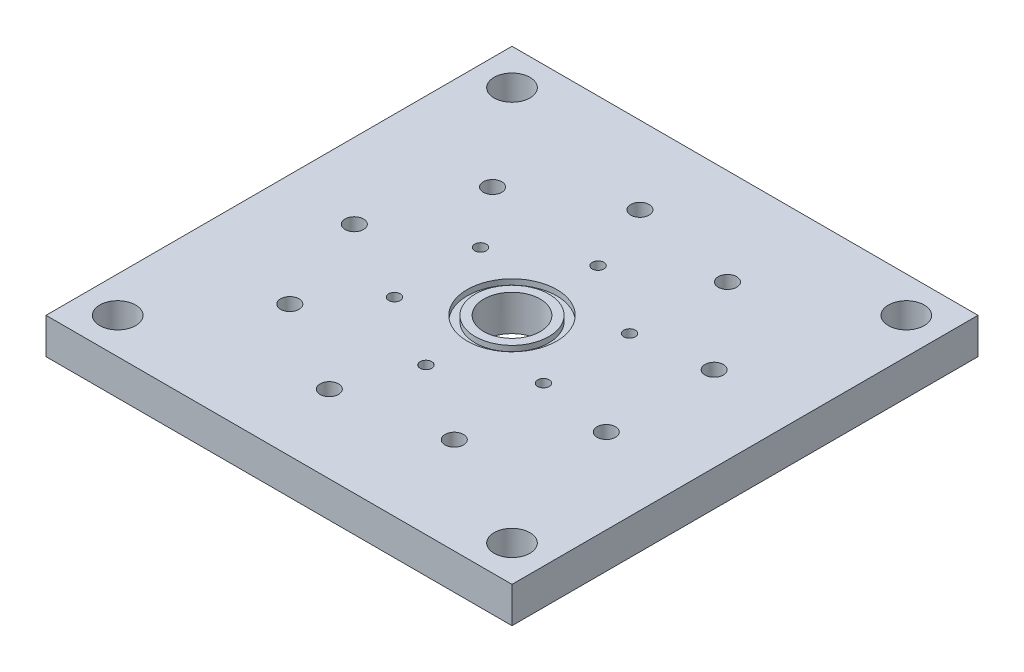
ISO-10303-21;
HEADER;
FILE_DESCRIPTION(('STEP AP214'),'2;1');
FILE_NAME('part.step','',(''),(''),'','','');
FILE_SCHEMA(('AUTOMOTIVE_DESIGN { 1 0 10303 214 1 1 1 1 }'));
ENDSEC;
DATA;
#1=APPLICATION_CONTEXT('core data for automotive mechanical design processes');
#2=APPLICATION_PROTOCOL_DEFINITION('international standard','automotive_design',2000,#1);
#3=PRODUCT_CONTEXT('',#1,'mechanical');
#4=PRODUCT('Part','Part','',(#3));
#5=PRODUCT_RELATED_PRODUCT_CATEGORY('part','',(#4));
#6=PRODUCT_DEFINITION_FORMATION('','',#4);
#7=PRODUCT_DEFINITION_CONTEXT('part definition',#1,'design');
#8=PRODUCT_DEFINITION('design','',#6,#7);
#9=PRODUCT_DEFINITION_SHAPE('','',#8);
#10=(LENGTH_UNIT() NAMED_UNIT(*) SI_UNIT(.MILLI.,.METRE.));
#11=(NAMED_UNIT(*) PLANE_ANGLE_UNIT() SI_UNIT($,.RADIAN.));
#12=(NAMED_UNIT(*) SI_UNIT($,.STERADIAN.) SOLID_ANGLE_UNIT());
#13=UNCERTAINTY_MEASURE_WITH_UNIT(LENGTH_MEASURE(1.E-05),#10,'distance_accuracy_value','');
#14=(GEOMETRIC_REPRESENTATION_CONTEXT(3) GLOBAL_UNCERTAINTY_ASSIGNED_CONTEXT((#13)) GLOBAL_UNIT_ASSIGNED_CONTEXT((#10,
#11,#12)) REPRESENTATION_CONTEXT('',''));
#15=CARTESIAN_POINT('',(0.,0.,0.));
#16=DIRECTION('',(0.,0.,1.));
#17=DIRECTION('',(1.,0.,0.));
#18=AXIS2_PLACEMENT_3D('',#15,#16,#17);
#19=CARTESIAN_POINT('',(0.,6.35,0.));
#20=DIRECTION('',(0.,-1.,0.));
#21=DIRECTION('',(0.,0.,-1.));
#22=AXIS2_PLACEMENT_3D('',#19,#20,#21);
#23=PLANE('',#22);
#24=CARTESIAN_POINT('',(0.,6.35,0.));
#25=DIRECTION('',(0.,1.,0.));
#26=DIRECTION('',(0.,0.,1.));
#27=AXIS2_PLACEMENT_3D('',#24,#25,#26);
#28=CIRCLE('',#27,4.99999);
#29=CARTESIAN_POINT('',(0.,6.35,4.99999));
#30=VERTEX_POINT('',#29);
#31=EDGE_CURVE('E112',#30,#30,#28,.T.);
#32=ORIENTED_EDGE('',*,*,#31,.F.);
#33=EDGE_LOOP('',(#32));
#34=FACE_BOUND('',#33,.T.);
#35=CARTESIAN_POINT('',(0.,6.35,0.));
#36=DIRECTION('',(0.,1.,0.));
#37=DIRECTION('',(0.,0.,1.));
#38=AXIS2_PLACEMENT_3D('',#35,#36,#37);
#39=CIRCLE('',#38,6.5278);
#40=CARTESIAN_POINT('',(0.,6.35,6.5278));
#41=VERTEX_POINT('',#40);
#42=EDGE_CURVE('E135',#41,#41,#39,.T.);
#43=ORIENTED_EDGE('',*,*,#42,.T.);
#44=EDGE_LOOP('',(#43));
#45=FACE_BOUND('',#44,.T.);
#46=ADVANCED_FACE('F45',(#34,#45),#23,.F.);
#47=CARTESIAN_POINT('',(41.275,6.35,41.275));
#48=DIRECTION('',(-1.,0.,0.));
#49=DIRECTION('',(0.,0.,1.));
#50=AXIS2_PLACEMENT_3D('',#47,#48,#49);
#51=PLANE('',#50);
#52=DIRECTION('',(0.,0.,-1.));
#53=VECTOR('',#52,1.);
#54=CARTESIAN_POINT('',(41.275,0.,41.275));
#55=LINE('',#54,#53);
#56=CARTESIAN_POINT('',(41.275,0.,41.275));
#57=VERTEX_POINT('',#56);
#58=CARTESIAN_POINT('',(41.275,0.,-41.275));
#59=VERTEX_POINT('',#58);
#60=EDGE_CURVE('E109',#57,#59,#55,.T.);
#61=ORIENTED_EDGE('',*,*,#60,.T.);
#62=DIRECTION('',(0.,-1.,0.));
#63=VECTOR('',#62,1.);
#64=CARTESIAN_POINT('',(41.275,6.35,-41.275));
#65=LINE('',#64,#63);
#66=CARTESIAN_POINT('',(41.275,6.35,-41.275));
#67=VERTEX_POINT('',#66);
#68=EDGE_CURVE('E13',#67,#59,#65,.T.);
#69=ORIENTED_EDGE('',*,*,#68,.F.);
#70=DIRECTION('',(0.,0.,-1.));
#71=VECTOR('',#70,1.);
#72=CARTESIAN_POINT('',(41.275,6.35,41.275));
#73=LINE('',#72,#71);
#74=CARTESIAN_POINT('',(41.275,6.35,41.275));
#75=VERTEX_POINT('',#74);
#76=EDGE_CURVE('E97',#75,#67,#73,.T.);
#77=ORIENTED_EDGE('',*,*,#76,.F.);
#78=DIRECTION('',(0.,-1.,0.));
#79=VECTOR('',#78,1.);
#80=CARTESIAN_POINT('',(41.275,6.35,41.275));
#81=LINE('',#80,#79);
#82=EDGE_CURVE('E105',#75,#57,#81,.T.);
#83=ORIENTED_EDGE('',*,*,#82,.T.);
#84=EDGE_LOOP('',(#61,#69,#77,#83));
#85=FACE_BOUND('',#84,.T.);
#86=ADVANCED_FACE('F47',(#85),#51,.F.);
#87=CARTESIAN_POINT('',(-41.275,6.35,-41.275));
#88=DIRECTION('',(0.,0.,1.));
#89=DIRECTION('',(1.,0.,0.));
#90=AXIS2_PLACEMENT_3D('',#87,#88,#89);
#91=PLANE('',#90);
#92=DIRECTION('',(-1.,0.,0.));
#93=VECTOR('',#92,1.);
#94=CARTESIAN_POINT('',(-41.275,0.,-41.275));
#95=LINE('',#94,#93);
#96=CARTESIAN_POINT('',(-41.275,0.,-41.275));
#97=VERTEX_POINT('',#96);
#98=EDGE_CURVE('E101',#59,#97,#95,.T.);
#99=ORIENTED_EDGE('',*,*,#98,.T.);
#100=DIRECTION('',(0.,-1.,0.));
#101=VECTOR('',#100,1.);
#102=CARTESIAN_POINT('',(-41.275,6.35,-41.275));
#103=LINE('',#102,#101);
#104=CARTESIAN_POINT('',(-41.275,6.35,-41.275));
#105=VERTEX_POINT('',#104);
#106=EDGE_CURVE('E54',#105,#97,#103,.T.);
#107=ORIENTED_EDGE('',*,*,#106,.F.);
#108=DIRECTION('',(-1.,0.,0.));
#109=VECTOR('',#108,1.);
#110=CARTESIAN_POINT('',(-41.275,6.35,-41.275));
#111=LINE('',#110,#109);
#112=EDGE_CURVE('E92',#67,#105,#111,.T.);
#113=ORIENTED_EDGE('',*,*,#112,.F.);
#114=ORIENTED_EDGE('',*,*,#68,.T.);
#115=EDGE_LOOP('',(#99,#107,#113,#114));
#116=FACE_BOUND('',#115,.T.);
#117=ADVANCED_FACE('F100',(#116),#91,.F.);
#118=CARTESIAN_POINT('',(-41.275,6.35,41.275));
#119=DIRECTION('',(1.,0.,0.));
#120=DIRECTION('',(0.,0.,-1.));
#121=AXIS2_PLACEMENT_3D('',#118,#119,#120);
#122=PLANE('',#121);
#123=DIRECTION('',(0.,0.,1.));
#124=VECTOR('',#123,1.);
#125=CARTESIAN_POINT('',(-41.275,0.,41.275));
#126=LINE('',#125,#124);
#127=CARTESIAN_POINT('',(-41.275,0.,41.275));
#128=VERTEX_POINT('',#127);
#129=EDGE_CURVE('E79',#97,#128,#126,.T.);
#130=ORIENTED_EDGE('',*,*,#129,.T.);
#131=DIRECTION('',(0.,-1.,0.));
#132=VECTOR('',#131,1.);
#133=CARTESIAN_POINT('',(-41.275,6.35,41.275));
#134=LINE('',#133,#132);
#135=CARTESIAN_POINT('',(-41.275,6.35,41.275));
#136=VERTEX_POINT('',#135);
#137=EDGE_CURVE('E102',#136,#128,#134,.T.);
#138=ORIENTED_EDGE('',*,*,#137,.F.);
#139=DIRECTION('',(0.,0.,1.));
#140=VECTOR('',#139,1.);
#141=CARTESIAN_POINT('',(-41.275,6.35,41.275));
#142=LINE('',#141,#140);
#143=EDGE_CURVE('E95',#105,#136,#142,.T.);
#144=ORIENTED_EDGE('',*,*,#143,.F.);
#145=ORIENTED_EDGE('',*,*,#106,.T.);
#146=EDGE_LOOP('',(#130,#138,#144,#145));
#147=FACE_BOUND('',#146,.T.);
#148=ADVANCED_FACE('F103',(#147),#122,.F.);
#149=CARTESIAN_POINT('',(-41.275,6.35,41.275));
#150=DIRECTION('',(0.,0.,-1.));
#151=DIRECTION('',(-1.,0.,0.));
#152=AXIS2_PLACEMENT_3D('',#149,#150,#151);
#153=PLANE('',#152);
#154=DIRECTION('',(1.,0.,0.));
#155=VECTOR('',#154,1.);
#156=CARTESIAN_POINT('',(-41.275,0.,41.275));
#157=LINE('',#156,#155);
#158=EDGE_CURVE('E85',#128,#57,#157,.T.);
#159=ORIENTED_EDGE('',*,*,#158,.T.);
#160=ORIENTED_EDGE('',*,*,#82,.F.);
#161=DIRECTION('',(1.,0.,0.));
#162=VECTOR('',#161,1.);
#163=CARTESIAN_POINT('',(-41.275,6.35,41.275));
#164=LINE('',#163,#162);
#165=EDGE_CURVE('E62',#136,#75,#164,.T.);
#166=ORIENTED_EDGE('',*,*,#165,.F.);
#167=ORIENTED_EDGE('',*,*,#137,.T.);
#168=EDGE_LOOP('',(#159,#160,#166,#167));
#169=FACE_BOUND('',#168,.T.);
#170=ADVANCED_FACE('F117',(#169),#153,.F.);
#171=CARTESIAN_POINT('',(-34.925,6.35,-34.925));
#172=DIRECTION('',(0.,1.,0.));
#173=DIRECTION('',(0.,0.,-1.));
#174=AXIS2_PLACEMENT_3D('',#171,#172,#173);
#175=CIRCLE('',#174,3.175);
#176=CARTESIAN_POINT('',(-34.925,6.35,-38.1));
#177=VERTEX_POINT('',#176);
#178=EDGE_CURVE('E246',#177,#177,#175,.T.);
#179=ORIENTED_EDGE('',*,*,#178,.F.);
#180=EDGE_LOOP('',(#179));
#181=FACE_BOUND('',#180,.T.);
#182=CARTESIAN_POINT('',(-34.925,6.35,34.925));
#183=DIRECTION('',(0.,1.,0.));
#184=DIRECTION('',(0.,0.,1.));
#185=AXIS2_PLACEMENT_3D('',#182,#183,#184);
#186=CIRCLE('',#185,3.175);
#187=CARTESIAN_POINT('',(-34.925,6.35,38.1));
#188=VERTEX_POINT('',#187);
#189=EDGE_CURVE('E240',#188,#188,#186,.T.);
#190=ORIENTED_EDGE('',*,*,#189,.F.);
#191=EDGE_LOOP('',(#190));
#192=FACE_BOUND('',#191,.T.);
#193=CARTESIAN_POINT('',(34.925,6.35,34.925));
#194=DIRECTION('',(0.,1.,0.));
#195=DIRECTION('',(0.,0.,-1.));
#196=AXIS2_PLACEMENT_3D('',#193,#194,#195);
#197=CIRCLE('',#196,3.175);
#198=CARTESIAN_POINT('',(34.925,6.35,31.75));
#199=VERTEX_POINT('',#198);
#200=EDGE_CURVE('E234',#199,#199,#197,.T.);
#201=ORIENTED_EDGE('',*,*,#200,.F.);
#202=EDGE_LOOP('',(#201));
#203=FACE_BOUND('',#202,.T.);
#204=CARTESIAN_POINT('',(34.925,6.35,-34.925));
#205=DIRECTION('',(0.,1.,0.));
#206=DIRECTION('',(0.,0.,1.));
#207=AXIS2_PLACEMENT_3D('',#204,#205,#206);
#208=CIRCLE('',#207,3.175);
#209=CARTESIAN_POINT('',(34.925,6.35,-31.75));
#210=VERTEX_POINT('',#209);
#211=EDGE_CURVE('E228',#210,#210,#208,.T.);
#212=ORIENTED_EDGE('',*,*,#211,.F.);
#213=EDGE_LOOP('',(#212));
#214=FACE_BOUND('',#213,.T.);
#215=CARTESIAN_POINT('',(-4.8517300840137,6.35,27.5155286191612));
#216=DIRECTION('',(0.,1.,0.));
#217=DIRECTION('',(-0.64278760968653,0.,0.766044443118986));
#218=AXIS2_PLACEMENT_3D('',#215,#216,#217);
#219=CIRCLE('',#218,1.63195);
#220=CARTESIAN_POINT('',(-5.90072732364164,6.35,28.7656748481092));
#221=VERTEX_POINT('',#220);
#222=EDGE_CURVE('E222',#221,#221,#219,.T.);
#223=ORIENTED_EDGE('',*,*,#222,.F.);
#224=EDGE_LOOP('',(#223));
#225=FACE_BOUND('',#224,.T.);
#226=CARTESIAN_POINT('',(-21.4032817407441,6.35,17.9594858146421));
#227=DIRECTION('',(0.,1.,0.));
#228=DIRECTION('',(-0.984807753012206,0.,0.17364817766694));
#229=AXIS2_PLACEMENT_3D('',#226,#227,#228);
#230=CIRCLE('',#229,1.63195);
#231=CARTESIAN_POINT('',(-23.0104387532723,6.35,18.2428709581857));
#232=VERTEX_POINT('',#231);
#233=EDGE_CURVE('E216',#232,#232,#230,.T.);
#234=ORIENTED_EDGE('',*,*,#233,.F.);
#235=EDGE_LOOP('',(#234));
#236=FACE_BOUND('',#235,.T.);
#237=CARTESIAN_POINT('',(-27.94,6.35,2.60208521396521E-13));
#238=DIRECTION('',(0.,1.,0.));
#239=DIRECTION('',(-0.866025403784443,0.,-0.499999999999992));
#240=AXIS2_PLACEMENT_3D('',#237,#238,#239);
#241=CIRCLE('',#240,1.63195);
#242=CARTESIAN_POINT('',(-29.353310157706,6.35,-0.815974999999728));
#243=VERTEX_POINT('',#242);
#244=EDGE_CURVE('E210',#243,#243,#241,.T.);
#245=ORIENTED_EDGE('',*,*,#244,.F.);
#246=EDGE_LOOP('',(#245));
#247=FACE_BOUND('',#246,.T.);
#248=CARTESIAN_POINT('',(-21.4032817407444,6.35,-17.9594858146418));
#249=DIRECTION('',(0.,1.,0.));
#250=DIRECTION('',(-0.342020143325676,0.,-0.939692620785906));
#251=AXIS2_PLACEMENT_3D('',#248,#249,#250);
#252=CIRCLE('',#251,1.63195);
#253=CARTESIAN_POINT('',(-21.9614415136447,6.35,-19.4930171871333));
#254=VERTEX_POINT('',#253);
#255=EDGE_CURVE('E204',#254,#254,#252,.T.);
#256=ORIENTED_EDGE('',*,*,#255,.F.);
#257=EDGE_LOOP('',(#256));
#258=FACE_BOUND('',#257,.T.);
#259=CARTESIAN_POINT('',(-4.8517300840142,6.35,-27.5155286191611));
#260=DIRECTION('',(0.,1.,0.));
#261=DIRECTION('',(0.342020143325663,0.,-0.939692620785911));
#262=AXIS2_PLACEMENT_3D('',#259,#260,#261);
#263=CIRCLE('',#262,1.63195);
#264=CARTESIAN_POINT('',(-4.29357031111389,6.35,-29.0490599916526));
#265=VERTEX_POINT('',#264);
#266=EDGE_CURVE('E198',#265,#265,#263,.T.);
#267=ORIENTED_EDGE('',*,*,#266,.F.);
#268=EDGE_LOOP('',(#267));
#269=FACE_BOUND('',#268,.T.);
#270=CARTESIAN_POINT('',(13.9699999999999,6.35,-24.1967497817373));
#271=DIRECTION('',(0.,1.,0.));
#272=DIRECTION('',(0.866025403784436,0.,-0.500000000000004));
#273=AXIS2_PLACEMENT_3D('',#270,#271,#272);
#274=CIRCLE('',#273,1.63195);
#275=CARTESIAN_POINT('',(15.3833101577059,6.35,-25.0127247817373));
#276=VERTEX_POINT('',#275);
#277=EDGE_CURVE('E192',#276,#276,#274,.T.);
#278=ORIENTED_EDGE('',*,*,#277,.F.);
#279=EDGE_LOOP('',(#278));
#280=FACE_BOUND('',#279,.T.);
#281=CARTESIAN_POINT('',(26.2550118247583,6.35,-9.55604280451924));
#282=DIRECTION('',(0.,1.,0.));
#283=DIRECTION('',(0.984807753012209,0.,0.173648177666927));
#284=AXIS2_PLACEMENT_3D('',#281,#282,#283);
#285=CIRCLE('',#284,1.63195);
#286=CARTESIAN_POINT('',(27.8621688372865,6.35,-9.2726576609757));
#287=VERTEX_POINT('',#286);
#288=EDGE_CURVE('E186',#287,#287,#285,.T.);
#289=ORIENTED_EDGE('',*,*,#288,.F.);
#290=EDGE_LOOP('',(#289));
#291=FACE_BOUND('',#290,.T.);
#292=CARTESIAN_POINT('',(26.2550118247583,6.35,9.55604280451918));
#293=DIRECTION('',(0.,1.,0.));
#294=DIRECTION('',(0.642787609686541,0.,0.766044443118977));
#295=AXIS2_PLACEMENT_3D('',#292,#293,#294);
#296=CIRCLE('',#295,1.63195);
#297=CARTESIAN_POINT('',(27.3040090643863,6.35,10.8061890334672));
#298=VERTEX_POINT('',#297);
#299=EDGE_CURVE('E180',#298,#298,#296,.T.);
#300=ORIENTED_EDGE('',*,*,#299,.F.);
#301=EDGE_LOOP('',(#300));
#302=FACE_BOUND('',#301,.T.);
#303=CARTESIAN_POINT('',(13.97,6.35,24.1967497817372));
#304=DIRECTION('',(0.,1.,0.));
#305=DIRECTION('',(0.,0.,1.));
#306=AXIS2_PLACEMENT_3D('',#303,#304,#305);
#307=CIRCLE('',#306,1.63195);
#308=CARTESIAN_POINT('',(13.97,6.35,25.8286997817372));
#309=VERTEX_POINT('',#308);
#310=EDGE_CURVE('E174',#309,#309,#307,.T.);
#311=ORIENTED_EDGE('',*,*,#310,.F.);
#312=EDGE_LOOP('',(#311));
#313=FACE_BOUND('',#312,.T.);
#314=CARTESIAN_POINT('',(-13.1982271536748,6.35,7.62000000000015));
#315=DIRECTION('',(0.,1.,0.));
#316=DIRECTION('',(-0.866025403784433,0.,0.50000000000001));
#317=AXIS2_PLACEMENT_3D('',#314,#315,#316);
#318=CIRCLE('',#317,1.03251);
#319=CARTESIAN_POINT('',(-14.0924070433362,6.35,8.13625500000017));
#320=VERTEX_POINT('',#319);
#321=EDGE_CURVE('E171',#320,#320,#318,.T.);
#322=ORIENTED_EDGE('',*,*,#321,.F.);
#323=EDGE_LOOP('',(#322));
#324=FACE_BOUND('',#323,.T.);
#325=CARTESIAN_POINT('',(-13.1982271536749,6.35,-7.61999999999988));
#326=DIRECTION('',(0.,1.,0.));
#327=DIRECTION('',(-0.866025403784443,0.,-0.499999999999992));
#328=AXIS2_PLACEMENT_3D('',#325,#326,#327);
#329=CIRCLE('',#328,1.03251);
#330=CARTESIAN_POINT('',(-14.0924070433364,6.35,-8.13625499999987));
#331=VERTEX_POINT('',#330);
#332=EDGE_CURVE('E165',#331,#331,#329,.T.);
#333=ORIENTED_EDGE('',*,*,#332,.F.);
#334=EDGE_LOOP('',(#333));
#335=FACE_BOUND('',#334,.T.);
#336=CARTESIAN_POINT('',(0.,6.35,-15.24));
#337=DIRECTION('',(0.,1.,0.));
#338=DIRECTION('',(0.,0.,-1.));
#339=AXIS2_PLACEMENT_3D('',#336,#337,#338);
#340=CIRCLE('',#339,1.03251);
#341=CARTESIAN_POINT('',(0.,6.35,-16.27251));
#342=VERTEX_POINT('',#341);
#343=EDGE_CURVE('E159',#342,#342,#340,.T.);
#344=ORIENTED_EDGE('',*,*,#343,.F.);
#345=EDGE_LOOP('',(#344));
#346=FACE_BOUND('',#345,.T.);
#347=CARTESIAN_POINT('',(13.1982271536748,6.35,-7.62000000000006));
#348=DIRECTION('',(0.,1.,0.));
#349=DIRECTION('',(0.866025403784436,0.,-0.500000000000004));
#350=AXIS2_PLACEMENT_3D('',#347,#348,#349);
#351=CIRCLE('',#350,1.03251);
#352=CARTESIAN_POINT('',(14.0924070433363,6.35,-8.13625500000007));
#353=VERTEX_POINT('',#352);
#354=EDGE_CURVE('E153',#353,#353,#351,.T.);
#355=ORIENTED_EDGE('',*,*,#354,.F.);
#356=EDGE_LOOP('',(#355));
#357=FACE_BOUND('',#356,.T.);
#358=CARTESIAN_POINT('',(13.1982271536749,6.35,7.61999999999997));
#359=DIRECTION('',(0.,1.,0.));
#360=DIRECTION('',(0.86602540378444,0.,0.499999999999998));
#361=AXIS2_PLACEMENT_3D('',#358,#359,#360);
#362=CIRCLE('',#361,1.03251);
#363=CARTESIAN_POINT('',(14.0924070433363,6.35,8.13625499999997));
#364=VERTEX_POINT('',#363);
#365=EDGE_CURVE('E147',#364,#364,#362,.T.);
#366=ORIENTED_EDGE('',*,*,#365,.F.);
#367=EDGE_LOOP('',(#366));
#368=FACE_BOUND('',#367,.T.);
#369=CARTESIAN_POINT('',(0.,6.35,15.24));
#370=DIRECTION('',(0.,1.,0.));
#371=DIRECTION('',(0.,0.,1.));
#372=AXIS2_PLACEMENT_3D('',#369,#370,#371);
#373=CIRCLE('',#372,1.03251);
#374=CARTESIAN_POINT('',(0.,6.35,16.27251));
#375=VERTEX_POINT('',#374);
#376=EDGE_CURVE('E141',#375,#375,#373,.T.);
#377=ORIENTED_EDGE('',*,*,#376,.F.);
#378=EDGE_LOOP('',(#377));
#379=FACE_BOUND('',#378,.T.);
#380=CARTESIAN_POINT('',(0.,6.35,0.));
#381=DIRECTION('',(0.,1.,0.));
#382=DIRECTION('',(0.,0.,1.));
#383=AXIS2_PLACEMENT_3D('',#380,#381,#382);
#384=CIRCLE('',#383,7.9248);
#385=CARTESIAN_POINT('',(0.,6.35,7.9248));
#386=VERTEX_POINT('',#385);
#387=EDGE_CURVE('E129',#386,#386,#384,.T.);
#388=ORIENTED_EDGE('',*,*,#387,.F.);
#389=EDGE_LOOP('',(#388));
#390=FACE_BOUND('',#389,.T.);
#391=ORIENTED_EDGE('',*,*,#76,.T.);
#392=ORIENTED_EDGE('',*,*,#112,.T.);
#393=ORIENTED_EDGE('',*,*,#143,.T.);
#394=ORIENTED_EDGE('',*,*,#165,.T.);
#395=EDGE_LOOP('',(#391,#392,#393,#394));
#396=FACE_BOUND('',#395,.T.);
#397=ADVANCED_FACE('F93',(#181,#192,#203,#214,#225,#236,#247,#258,#269,#280,#291,#302,#313,#324,
#335,#346,#357,#368,#379,#390,#396),#23,.F.);
#398=CARTESIAN_POINT('',(0.,0.,0.));
#399=DIRECTION('',(0.,-1.,0.));
#400=DIRECTION('',(0.,0.,-1.));
#401=AXIS2_PLACEMENT_3D('',#398,#399,#400);
#402=PLANE('',#401);
#403=CARTESIAN_POINT('',(-34.925,0.,-34.925));
#404=DIRECTION('',(0.,-1.,0.));
#405=DIRECTION('',(0.,0.,-1.));
#406=AXIS2_PLACEMENT_3D('',#403,#404,#405);
#407=CIRCLE('',#406,3.175);
#408=CARTESIAN_POINT('',(-34.925,0.,-38.1));
#409=VERTEX_POINT('',#408);
#410=EDGE_CURVE('E249',#409,#409,#407,.F.);
#411=ORIENTED_EDGE('',*,*,#410,.T.);
#412=EDGE_LOOP('',(#411));
#413=FACE_BOUND('',#412,.T.);
#414=CARTESIAN_POINT('',(-34.925,0.,34.925));
#415=DIRECTION('',(0.,-1.,0.));
#416=DIRECTION('',(0.,0.,-1.));
#417=AXIS2_PLACEMENT_3D('',#414,#415,#416);
#418=CIRCLE('',#417,3.175);
#419=CARTESIAN_POINT('',(-34.925,0.,31.75));
#420=VERTEX_POINT('',#419);
#421=EDGE_CURVE('E243',#420,#420,#418,.F.);
#422=ORIENTED_EDGE('',*,*,#421,.T.);
#423=EDGE_LOOP('',(#422));
#424=FACE_BOUND('',#423,.T.);
#425=CARTESIAN_POINT('',(34.925,0.,34.925));
#426=DIRECTION('',(0.,-1.,0.));
#427=DIRECTION('',(0.,0.,-1.));
#428=AXIS2_PLACEMENT_3D('',#425,#426,#427);
#429=CIRCLE('',#428,3.175);
#430=CARTESIAN_POINT('',(34.925,0.,31.75));
#431=VERTEX_POINT('',#430);
#432=EDGE_CURVE('E237',#431,#431,#429,.F.);
#433=ORIENTED_EDGE('',*,*,#432,.T.);
#434=EDGE_LOOP('',(#433));
#435=FACE_BOUND('',#434,.T.);
#436=CARTESIAN_POINT('',(34.925,0.,-34.925));
#437=DIRECTION('',(0.,-1.,0.));
#438=DIRECTION('',(0.,0.,-1.));
#439=AXIS2_PLACEMENT_3D('',#436,#437,#438);
#440=CIRCLE('',#439,3.175);
#441=CARTESIAN_POINT('',(34.925,0.,-38.1));
#442=VERTEX_POINT('',#441);
#443=EDGE_CURVE('E231',#442,#442,#440,.F.);
#444=ORIENTED_EDGE('',*,*,#443,.T.);
#445=EDGE_LOOP('',(#444));
#446=FACE_BOUND('',#445,.T.);
#447=CARTESIAN_POINT('',(-4.8517300840137,0.,27.5155286191612));
#448=DIRECTION('',(0.,-1.,0.));
#449=DIRECTION('',(0.,0.,-1.));
#450=AXIS2_PLACEMENT_3D('',#447,#448,#449);
#451=CIRCLE('',#450,1.63195);
#452=CARTESIAN_POINT('',(-4.8517300840137,0.,25.8835786191612));
#453=VERTEX_POINT('',#452);
#454=EDGE_CURVE('E225',#453,#453,#451,.F.);
#455=ORIENTED_EDGE('',*,*,#454,.T.);
#456=EDGE_LOOP('',(#455));
#457=FACE_BOUND('',#456,.T.);
#458=CARTESIAN_POINT('',(-21.4032817407441,0.,17.9594858146421));
#459=DIRECTION('',(0.,-1.,0.));
#460=DIRECTION('',(0.,0.,-1.));
#461=AXIS2_PLACEMENT_3D('',#458,#459,#460);
#462=CIRCLE('',#461,1.63195);
#463=CARTESIAN_POINT('',(-21.4032817407441,0.,16.3275358146421));
#464=VERTEX_POINT('',#463);
#465=EDGE_CURVE('E219',#464,#464,#462,.F.);
#466=ORIENTED_EDGE('',*,*,#465,.T.);
#467=EDGE_LOOP('',(#466));
#468=FACE_BOUND('',#467,.T.);
#469=CARTESIAN_POINT('',(-27.94,0.,2.60208521396521E-13));
#470=DIRECTION('',(0.,-1.,0.));
#471=DIRECTION('',(0.,0.,-1.));
#472=AXIS2_PLACEMENT_3D('',#469,#470,#471);
#473=CIRCLE('',#472,1.63195);
#474=CARTESIAN_POINT('',(-27.94,0.,-1.63194999999974));
#475=VERTEX_POINT('',#474);
#476=EDGE_CURVE('E213',#475,#475,#473,.F.);
#477=ORIENTED_EDGE('',*,*,#476,.T.);
#478=EDGE_LOOP('',(#477));
#479=FACE_BOUND('',#478,.T.);
#480=CARTESIAN_POINT('',(-21.4032817407444,0.,-17.9594858146418));
#481=DIRECTION('',(0.,-1.,0.));
#482=DIRECTION('',(0.,0.,-1.));
#483=AXIS2_PLACEMENT_3D('',#480,#481,#482);
#484=CIRCLE('',#483,1.63195);
#485=CARTESIAN_POINT('',(-21.4032817407444,0.,-19.5914358146418));
#486=VERTEX_POINT('',#485);
#487=EDGE_CURVE('E207',#486,#486,#484,.F.);
#488=ORIENTED_EDGE('',*,*,#487,.T.);
#489=EDGE_LOOP('',(#488));
#490=FACE_BOUND('',#489,.T.);
#491=CARTESIAN_POINT('',(-4.8517300840142,0.,-27.5155286191611));
#492=DIRECTION('',(0.,-1.,0.));
#493=DIRECTION('',(0.,0.,-1.));
#494=AXIS2_PLACEMENT_3D('',#491,#492,#493);
#495=CIRCLE('',#494,1.63195);
#496=CARTESIAN_POINT('',(-4.8517300840142,0.,-29.1474786191611));
#497=VERTEX_POINT('',#496);
#498=EDGE_CURVE('E201',#497,#497,#495,.F.);
#499=ORIENTED_EDGE('',*,*,#498,.T.);
#500=EDGE_LOOP('',(#499));
#501=FACE_BOUND('',#500,.T.);
#502=CARTESIAN_POINT('',(13.9699999999999,0.,-24.1967497817373));
#503=DIRECTION('',(0.,-1.,0.));
#504=DIRECTION('',(0.,0.,-1.));
#505=AXIS2_PLACEMENT_3D('',#502,#503,#504);
#506=CIRCLE('',#505,1.63195);
#507=CARTESIAN_POINT('',(13.9699999999999,0.,-25.8286997817373));
#508=VERTEX_POINT('',#507);
#509=EDGE_CURVE('E195',#508,#508,#506,.F.);
#510=ORIENTED_EDGE('',*,*,#509,.T.);
#511=EDGE_LOOP('',(#510));
#512=FACE_BOUND('',#511,.T.);
#513=CARTESIAN_POINT('',(26.2550118247583,0.,-9.55604280451927));
#514=DIRECTION('',(0.,-1.,0.));
#515=DIRECTION('',(0.,0.,-1.));
#516=AXIS2_PLACEMENT_3D('',#513,#514,#515);
#517=CIRCLE('',#516,1.63195);
#518=CARTESIAN_POINT('',(26.2550118247583,0.,-11.1879928045193));
#519=VERTEX_POINT('',#518);
#520=EDGE_CURVE('E189',#519,#519,#517,.F.);
#521=ORIENTED_EDGE('',*,*,#520,.T.);
#522=EDGE_LOOP('',(#521));
#523=FACE_BOUND('',#522,.T.);
#524=CARTESIAN_POINT('',(26.2550118247583,0.,9.55604280451915));
#525=DIRECTION('',(0.,-1.,0.));
#526=DIRECTION('',(0.,0.,-1.));
#527=AXIS2_PLACEMENT_3D('',#524,#525,#526);
#528=CIRCLE('',#527,1.63195);
#529=CARTESIAN_POINT('',(26.2550118247583,0.,7.92409280451915));
#530=VERTEX_POINT('',#529);
#531=EDGE_CURVE('E183',#530,#530,#528,.F.);
#532=ORIENTED_EDGE('',*,*,#531,.T.);
#533=EDGE_LOOP('',(#532));
#534=FACE_BOUND('',#533,.T.);
#535=CARTESIAN_POINT('',(13.97,0.,24.1967497817372));
#536=DIRECTION('',(0.,-1.,0.));
#537=DIRECTION('',(0.,0.,-1.));
#538=AXIS2_PLACEMENT_3D('',#535,#536,#537);
#539=CIRCLE('',#538,1.63195);
#540=CARTESIAN_POINT('',(13.97,0.,22.5647997817372));
#541=VERTEX_POINT('',#540);
#542=EDGE_CURVE('E177',#541,#541,#539,.F.);
#543=ORIENTED_EDGE('',*,*,#542,.T.);
#544=EDGE_LOOP('',(#543));
#545=FACE_BOUND('',#544,.T.);
#546=CARTESIAN_POINT('',(0.,0.,0.));
#547=DIRECTION('',(0.,-1.,0.));
#548=DIRECTION('',(0.,0.,-1.));
#549=AXIS2_PLACEMENT_3D('',#546,#547,#548);
#550=CIRCLE('',#549,4.99999);
#551=CARTESIAN_POINT('',(0.,0.,-4.99999));
#552=VERTEX_POINT('',#551);
#553=EDGE_CURVE('E123',#552,#552,#550,.F.);
#554=ORIENTED_EDGE('',*,*,#553,.T.);
#555=EDGE_LOOP('',(#554));
#556=FACE_BOUND('',#555,.T.);
#557=ORIENTED_EDGE('',*,*,#60,.F.);
#558=ORIENTED_EDGE('',*,*,#158,.F.);
#559=ORIENTED_EDGE('',*,*,#129,.F.);
#560=ORIENTED_EDGE('',*,*,#98,.F.);
#561=EDGE_LOOP('',(#557,#558,#559,#560));
#562=FACE_BOUND('',#561,.T.);
#563=ADVANCED_FACE('F120',(#413,#424,#435,#446,#457,#468,#479,#490,#501,#512,#523,#534,#545,
#556,#562),#402,.T.);
#564=CARTESIAN_POINT('',(0.,-0.001000000000001,0.));
#565=DIRECTION('',(0.,1.,0.));
#566=DIRECTION('',(0.,0.,1.));
#567=AXIS2_PLACEMENT_3D('',#564,#565,#566);
#568=CYLINDRICAL_SURFACE('',#567,4.99999);
#569=ORIENTED_EDGE('',*,*,#553,.F.);
#570=EDGE_LOOP('',(#569));
#571=FACE_BOUND('',#570,.T.);
#572=ORIENTED_EDGE('',*,*,#31,.T.);
#573=EDGE_LOOP('',(#572));
#574=FACE_BOUND('',#573,.T.);
#575=ADVANCED_FACE('F301',(#571,#574),#568,.F.);
#576=CARTESIAN_POINT('',(0.,5.3721,0.));
#577=DIRECTION('',(0.,1.,0.));
#578=DIRECTION('',(0.,0.,1.));
#579=AXIS2_PLACEMENT_3D('',#576,#577,#578);
#580=CYLINDRICAL_SURFACE('',#579,7.9248);
#581=CARTESIAN_POINT('',(0.,5.3721,0.));
#582=DIRECTION('',(0.,1.,0.));
#583=DIRECTION('',(0.,0.,1.));
#584=AXIS2_PLACEMENT_3D('',#581,#582,#583);
#585=CIRCLE('',#584,7.9248);
#586=CARTESIAN_POINT('',(0.,5.3721,7.9248));
#587=VERTEX_POINT('',#586);
#588=EDGE_CURVE('E126',#587,#587,#585,.T.);
#589=ORIENTED_EDGE('',*,*,#588,.F.);
#590=EDGE_LOOP('',(#589));
#591=FACE_BOUND('',#590,.T.);
#592=ORIENTED_EDGE('',*,*,#387,.T.);
#593=EDGE_LOOP('',(#592));
#594=FACE_BOUND('',#593,.T.);
#595=ADVANCED_FACE('F298',(#591,#594),#580,.F.);
#596=CARTESIAN_POINT('',(0.,5.3721,0.));
#597=DIRECTION('',(0.,1.,0.));
#598=DIRECTION('',(0.,0.,1.));
#599=AXIS2_PLACEMENT_3D('',#596,#597,#598);
#600=PLANE('',#599);
#601=CARTESIAN_POINT('',(0.,5.3721,0.));
#602=DIRECTION('',(0.,1.,0.));
#603=DIRECTION('',(0.,0.,1.));
#604=AXIS2_PLACEMENT_3D('',#601,#602,#603);
#605=CIRCLE('',#604,6.5278);
#606=CARTESIAN_POINT('',(0.,5.3721,6.5278));
#607=VERTEX_POINT('',#606);
#608=EDGE_CURVE('E132',#607,#607,#605,.T.);
#609=ORIENTED_EDGE('',*,*,#608,.F.);
#610=EDGE_LOOP('',(#609));
#611=FACE_BOUND('',#610,.T.);
#612=ORIENTED_EDGE('',*,*,#588,.T.);
#613=EDGE_LOOP('',(#612));
#614=FACE_BOUND('',#613,.T.);
#615=ADVANCED_FACE('F300',(#611,#614),#600,.T.);
#616=CARTESIAN_POINT('',(0.,5.3721,0.));
#617=DIRECTION('',(0.,1.,0.));
#618=DIRECTION('',(0.,0.,1.));
#619=AXIS2_PLACEMENT_3D('',#616,#617,#618);
#620=CYLINDRICAL_SURFACE('',#619,6.5278);
#621=ORIENTED_EDGE('',*,*,#608,.T.);
#622=EDGE_LOOP('',(#621));
#623=FACE_BOUND('',#622,.T.);
#624=ORIENTED_EDGE('',*,*,#42,.F.);
#625=EDGE_LOOP('',(#624));
#626=FACE_BOUND('',#625,.T.);
#627=ADVANCED_FACE('F308',(#623,#626),#620,.T.);
#628=CARTESIAN_POINT('',(0.,3.175,15.24));
#629=DIRECTION('',(0.,1.,0.));
#630=DIRECTION('',(0.,0.,1.));
#631=AXIS2_PLACEMENT_3D('',#628,#629,#630);
#632=CYLINDRICAL_SURFACE('',#631,1.03251);
#633=CARTESIAN_POINT('',(0.,3.175,15.24));
#634=DIRECTION('',(0.,1.,0.));
#635=DIRECTION('',(0.,0.,1.));
#636=AXIS2_PLACEMENT_3D('',#633,#634,#635);
#637=CIRCLE('',#636,1.03251);
#638=CARTESIAN_POINT('',(0.,3.175,16.27251));
#639=VERTEX_POINT('',#638);
#640=EDGE_CURVE('E138',#639,#639,#637,.T.);
#641=ORIENTED_EDGE('',*,*,#640,.F.);
#642=EDGE_LOOP('',(#641));
#643=FACE_BOUND('',#642,.T.);
#644=ORIENTED_EDGE('',*,*,#376,.T.);
#645=EDGE_LOOP('',(#644));
#646=FACE_BOUND('',#645,.T.);
#647=ADVANCED_FACE('F368',(#643,#646),#632,.F.);
#648=CARTESIAN_POINT('',(0.,3.175,15.24));
#649=DIRECTION('',(0.,1.,0.));
#650=DIRECTION('',(0.,0.,1.));
#651=AXIS2_PLACEMENT_3D('',#648,#649,#650);
#652=PLANE('',#651);
#653=ORIENTED_EDGE('',*,*,#640,.T.);
#654=EDGE_LOOP('',(#653));
#655=FACE_BOUND('',#654,.T.);
#656=ADVANCED_FACE('F376',(#655),#652,.T.);
#657=CARTESIAN_POINT('',(13.1982271536749,3.175,7.61999999999997));
#658=DIRECTION('',(0.,1.,0.));
#659=DIRECTION('',(0.,0.,1.));
#660=AXIS2_PLACEMENT_3D('',#657,#658,#659);
#661=CYLINDRICAL_SURFACE('',#660,1.03251);
#662=CARTESIAN_POINT('',(13.1982271536749,3.175,7.61999999999997));
#663=DIRECTION('',(0.,1.,0.));
#664=DIRECTION('',(0.86602540378444,0.,0.499999999999998));
#665=AXIS2_PLACEMENT_3D('',#662,#663,#664);
#666=CIRCLE('',#665,1.03251);
#667=CARTESIAN_POINT('',(14.0924070433363,3.175,8.13625499999997));
#668=VERTEX_POINT('',#667);
#669=EDGE_CURVE('E144',#668,#668,#666,.T.);
#670=ORIENTED_EDGE('',*,*,#669,.F.);
#671=EDGE_LOOP('',(#670));
#672=FACE_BOUND('',#671,.T.);
#673=ORIENTED_EDGE('',*,*,#365,.T.);
#674=EDGE_LOOP('',(#673));
#675=FACE_BOUND('',#674,.T.);
#676=ADVANCED_FACE('F384',(#672,#675),#661,.F.);
#677=CARTESIAN_POINT('',(13.1982271536749,3.175,7.61999999999997));
#678=DIRECTION('',(0.,1.,0.));
#679=DIRECTION('',(0.86602540378444,0.,0.499999999999998));
#680=AXIS2_PLACEMENT_3D('',#677,#678,#679);
#681=PLANE('',#680);
#682=ORIENTED_EDGE('',*,*,#669,.T.);
#683=EDGE_LOOP('',(#682));
#684=FACE_BOUND('',#683,.T.);
#685=ADVANCED_FACE('F392',(#684),#681,.T.);
#686=CARTESIAN_POINT('',(13.1982271536748,3.175,-7.62000000000006));
#687=DIRECTION('',(0.,1.,0.));
#688=DIRECTION('',(0.,0.,1.));
#689=AXIS2_PLACEMENT_3D('',#686,#687,#688);
#690=CYLINDRICAL_SURFACE('',#689,1.03251);
#691=CARTESIAN_POINT('',(13.1982271536748,3.175,-7.62000000000006));
#692=DIRECTION('',(0.,1.,0.));
#693=DIRECTION('',(0.866025403784436,0.,-0.500000000000004));
#694=AXIS2_PLACEMENT_3D('',#691,#692,#693);
#695=CIRCLE('',#694,1.03251);
#696=CARTESIAN_POINT('',(14.0924070433363,3.175,-8.13625500000007));
#697=VERTEX_POINT('',#696);
#698=EDGE_CURVE('E150',#697,#697,#695,.T.);
#699=ORIENTED_EDGE('',*,*,#698,.F.);
#700=EDGE_LOOP('',(#699));
#701=FACE_BOUND('',#700,.T.);
#702=ORIENTED_EDGE('',*,*,#354,.T.);
#703=EDGE_LOOP('',(#702));
#704=FACE_BOUND('',#703,.T.);
#705=ADVANCED_FACE('F400',(#701,#704),#690,.F.);
#706=CARTESIAN_POINT('',(13.1982271536748,3.175,-7.62000000000006));
#707=DIRECTION('',(0.,1.,0.));
#708=DIRECTION('',(0.866025403784436,0.,-0.500000000000004));
#709=AXIS2_PLACEMENT_3D('',#706,#707,#708);
#710=PLANE('',#709);
#711=ORIENTED_EDGE('',*,*,#698,.T.);
#712=EDGE_LOOP('',(#711));
#713=FACE_BOUND('',#712,.T.);
#714=ADVANCED_FACE('F408',(#713),#710,.T.);
#715=CARTESIAN_POINT('',(0.,3.175,-15.24));
#716=DIRECTION('',(0.,1.,0.));
#717=DIRECTION('',(0.,0.,1.));
#718=AXIS2_PLACEMENT_3D('',#715,#716,#717);
#719=CYLINDRICAL_SURFACE('',#718,1.03251);
#720=CARTESIAN_POINT('',(0.,3.175,-15.24));
#721=DIRECTION('',(0.,1.,0.));
#722=DIRECTION('',(0.,0.,-1.));
#723=AXIS2_PLACEMENT_3D('',#720,#721,#722);
#724=CIRCLE('',#723,1.03251);
#725=CARTESIAN_POINT('',(0.,3.175,-16.27251));
#726=VERTEX_POINT('',#725);
#727=EDGE_CURVE('E156',#726,#726,#724,.T.);
#728=ORIENTED_EDGE('',*,*,#727,.F.);
#729=EDGE_LOOP('',(#728));
#730=FACE_BOUND('',#729,.T.);
#731=ORIENTED_EDGE('',*,*,#343,.T.);
#732=EDGE_LOOP('',(#731));
#733=FACE_BOUND('',#732,.T.);
#734=ADVANCED_FACE('F416',(#730,#733),#719,.F.);
#735=CARTESIAN_POINT('',(0.,3.175,-15.24));
#736=DIRECTION('',(0.,1.,0.));
#737=DIRECTION('',(0.,0.,-1.));
#738=AXIS2_PLACEMENT_3D('',#735,#736,#737);
#739=PLANE('',#738);
#740=ORIENTED_EDGE('',*,*,#727,.T.);
#741=EDGE_LOOP('',(#740));
#742=FACE_BOUND('',#741,.T.);
#743=ADVANCED_FACE('F424',(#742),#739,.T.);
#744=CARTESIAN_POINT('',(-13.1982271536749,3.175,-7.61999999999988));
#745=DIRECTION('',(0.,1.,0.));
#746=DIRECTION('',(0.,0.,1.));
#747=AXIS2_PLACEMENT_3D('',#744,#745,#746);
#748=CYLINDRICAL_SURFACE('',#747,1.03251);
#749=CARTESIAN_POINT('',(-13.1982271536749,3.175,-7.61999999999988));
#750=DIRECTION('',(0.,1.,0.));
#751=DIRECTION('',(-0.866025403784443,0.,-0.499999999999992));
#752=AXIS2_PLACEMENT_3D('',#749,#750,#751);
#753=CIRCLE('',#752,1.03251);
#754=CARTESIAN_POINT('',(-14.0924070433364,3.175,-8.13625499999987));
#755=VERTEX_POINT('',#754);
#756=EDGE_CURVE('E162',#755,#755,#753,.T.);
#757=ORIENTED_EDGE('',*,*,#756,.F.);
#758=EDGE_LOOP('',(#757));
#759=FACE_BOUND('',#758,.T.);
#760=ORIENTED_EDGE('',*,*,#332,.T.);
#761=EDGE_LOOP('',(#760));
#762=FACE_BOUND('',#761,.T.);
#763=ADVANCED_FACE('F432',(#759,#762),#748,.F.);
#764=CARTESIAN_POINT('',(-13.1982271536749,3.175,-7.61999999999988));
#765=DIRECTION('',(0.,1.,0.));
#766=DIRECTION('',(-0.866025403784443,0.,-0.499999999999992));
#767=AXIS2_PLACEMENT_3D('',#764,#765,#766);
#768=PLANE('',#767);
#769=ORIENTED_EDGE('',*,*,#756,.T.);
#770=EDGE_LOOP('',(#769));
#771=FACE_BOUND('',#770,.T.);
#772=ADVANCED_FACE('F440',(#771),#768,.T.);
#773=CARTESIAN_POINT('',(-13.1982271536748,3.175,7.62000000000015));
#774=DIRECTION('',(0.,1.,0.));
#775=DIRECTION('',(0.,0.,1.));
#776=AXIS2_PLACEMENT_3D('',#773,#774,#775);
#777=CYLINDRICAL_SURFACE('',#776,1.03251);
#778=CARTESIAN_POINT('',(-13.1982271536748,3.175,7.62000000000015));
#779=DIRECTION('',(0.,1.,0.));
#780=DIRECTION('',(-0.866025403784433,0.,0.50000000000001));
#781=AXIS2_PLACEMENT_3D('',#778,#779,#780);
#782=CIRCLE('',#781,1.03251);
#783=CARTESIAN_POINT('',(-14.0924070433362,3.175,8.13625500000017));
#784=VERTEX_POINT('',#783);
#785=EDGE_CURVE('E168',#784,#784,#782,.T.);
#786=ORIENTED_EDGE('',*,*,#785,.F.);
#787=EDGE_LOOP('',(#786));
#788=FACE_BOUND('',#787,.T.);
#789=ORIENTED_EDGE('',*,*,#321,.T.);
#790=EDGE_LOOP('',(#789));
#791=FACE_BOUND('',#790,.T.);
#792=ADVANCED_FACE('F448',(#788,#791),#777,.F.);
#793=CARTESIAN_POINT('',(-13.1982271536748,3.175,7.62000000000015));
#794=DIRECTION('',(0.,1.,0.));
#795=DIRECTION('',(-0.866025403784433,0.,0.50000000000001));
#796=AXIS2_PLACEMENT_3D('',#793,#794,#795);
#797=PLANE('',#796);
#798=ORIENTED_EDGE('',*,*,#785,.T.);
#799=EDGE_LOOP('',(#798));
#800=FACE_BOUND('',#799,.T.);
#801=ADVANCED_FACE('F456',(#800),#797,.T.);
#802=CARTESIAN_POINT('',(13.97,-0.001000000000001,24.1967497817372));
#803=DIRECTION('',(0.,1.,0.));
#804=DIRECTION('',(0.,0.,1.));
#805=AXIS2_PLACEMENT_3D('',#802,#803,#804);
#806=CYLINDRICAL_SURFACE('',#805,1.63195);
#807=ORIENTED_EDGE('',*,*,#542,.F.);
#808=EDGE_LOOP('',(#807));
#809=FACE_BOUND('',#808,.T.);
#810=ORIENTED_EDGE('',*,*,#310,.T.);
#811=EDGE_LOOP('',(#810));
#812=FACE_BOUND('',#811,.T.);
#813=ADVANCED_FACE('F464',(#809,#812),#806,.F.);
#814=CARTESIAN_POINT('',(26.2550118247583,-0.001000000000001,9.55604280451915));
#815=DIRECTION('',(0.,1.,0.));
#816=DIRECTION('',(0.,0.,1.));
#817=AXIS2_PLACEMENT_3D('',#814,#815,#816);
#818=CYLINDRICAL_SURFACE('',#817,1.63195);
#819=ORIENTED_EDGE('',*,*,#531,.F.);
#820=EDGE_LOOP('',(#819));
#821=FACE_BOUND('',#820,.T.);
#822=ORIENTED_EDGE('',*,*,#299,.T.);
#823=EDGE_LOOP('',(#822));
#824=FACE_BOUND('',#823,.T.);
#825=ADVANCED_FACE('F472',(#821,#824),#818,.F.);
#826=CARTESIAN_POINT('',(26.2550118247583,-0.000999999999999265,-9.55604280451927));
#827=DIRECTION('',(0.,1.,0.));
#828=DIRECTION('',(0.,0.,1.));
#829=AXIS2_PLACEMENT_3D('',#826,#827,#828);
#830=CYLINDRICAL_SURFACE('',#829,1.63195);
#831=ORIENTED_EDGE('',*,*,#520,.F.);
#832=EDGE_LOOP('',(#831));
#833=FACE_BOUND('',#832,.T.);
#834=ORIENTED_EDGE('',*,*,#288,.T.);
#835=EDGE_LOOP('',(#834));
#836=FACE_BOUND('',#835,.T.);
#837=ADVANCED_FACE('F480',(#833,#836),#830,.F.);
#838=CARTESIAN_POINT('',(13.9699999999999,-0.000999999999999265,-24.1967497817373));
#839=DIRECTION('',(0.,1.,0.));
#840=DIRECTION('',(0.,0.,1.));
#841=AXIS2_PLACEMENT_3D('',#838,#839,#840);
#842=CYLINDRICAL_SURFACE('',#841,1.63195);
#843=ORIENTED_EDGE('',*,*,#509,.F.);
#844=EDGE_LOOP('',(#843));
#845=FACE_BOUND('',#844,.T.);
#846=ORIENTED_EDGE('',*,*,#277,.T.);
#847=EDGE_LOOP('',(#846));
#848=FACE_BOUND('',#847,.T.);
#849=ADVANCED_FACE('F488',(#845,#848),#842,.F.);
#850=CARTESIAN_POINT('',(-4.8517300840142,-0.001000000000001,-27.5155286191611));
#851=DIRECTION('',(0.,1.,0.));
#852=DIRECTION('',(0.,0.,1.));
#853=AXIS2_PLACEMENT_3D('',#850,#851,#852);
#854=CYLINDRICAL_SURFACE('',#853,1.63195);
#855=ORIENTED_EDGE('',*,*,#498,.F.);
#856=EDGE_LOOP('',(#855));
#857=FACE_BOUND('',#856,.T.);
#858=ORIENTED_EDGE('',*,*,#266,.T.);
#859=EDGE_LOOP('',(#858));
#860=FACE_BOUND('',#859,.T.);
#861=ADVANCED_FACE('F496',(#857,#860),#854,.F.);
#862=CARTESIAN_POINT('',(-21.4032817407444,-0.000999999999999265,-17.9594858146418));
#863=DIRECTION('',(0.,1.,0.));
#864=DIRECTION('',(0.,0.,1.));
#865=AXIS2_PLACEMENT_3D('',#862,#863,#864);
#866=CYLINDRICAL_SURFACE('',#865,1.63195);
#867=ORIENTED_EDGE('',*,*,#487,.F.);
#868=EDGE_LOOP('',(#867));
#869=FACE_BOUND('',#868,.T.);
#870=ORIENTED_EDGE('',*,*,#255,.T.);
#871=EDGE_LOOP('',(#870));
#872=FACE_BOUND('',#871,.T.);
#873=ADVANCED_FACE('F504',(#869,#872),#866,.F.);
#874=CARTESIAN_POINT('',(-27.94,-0.001000000000001,2.60208521396521E-13));
#875=DIRECTION('',(0.,1.,0.));
#876=DIRECTION('',(0.,0.,1.));
#877=AXIS2_PLACEMENT_3D('',#874,#875,#876);
#878=CYLINDRICAL_SURFACE('',#877,1.63195);
#879=ORIENTED_EDGE('',*,*,#476,.F.);
#880=EDGE_LOOP('',(#879));
#881=FACE_BOUND('',#880,.T.);
#882=ORIENTED_EDGE('',*,*,#244,.T.);
#883=EDGE_LOOP('',(#882));
#884=FACE_BOUND('',#883,.T.);
#885=ADVANCED_FACE('F512',(#881,#884),#878,.F.);
#886=CARTESIAN_POINT('',(-21.4032817407441,-0.001000000000001,17.9594858146421));
#887=DIRECTION('',(0.,1.,0.));
#888=DIRECTION('',(0.,0.,1.));
#889=AXIS2_PLACEMENT_3D('',#886,#887,#888);
#890=CYLINDRICAL_SURFACE('',#889,1.63195);
#891=ORIENTED_EDGE('',*,*,#465,.F.);
#892=EDGE_LOOP('',(#891));
#893=FACE_BOUND('',#892,.T.);
#894=ORIENTED_EDGE('',*,*,#233,.T.);
#895=EDGE_LOOP('',(#894));
#896=FACE_BOUND('',#895,.T.);
#897=ADVANCED_FACE('F520',(#893,#896),#890,.F.);
#898=CARTESIAN_POINT('',(-4.8517300840137,-0.000999999999999265,27.5155286191612));
#899=DIRECTION('',(0.,1.,0.));
#900=DIRECTION('',(0.,0.,1.));
#901=AXIS2_PLACEMENT_3D('',#898,#899,#900);
#902=CYLINDRICAL_SURFACE('',#901,1.63195);
#903=ORIENTED_EDGE('',*,*,#454,.F.);
#904=EDGE_LOOP('',(#903));
#905=FACE_BOUND('',#904,.T.);
#906=ORIENTED_EDGE('',*,*,#222,.T.);
#907=EDGE_LOOP('',(#906));
#908=FACE_BOUND('',#907,.T.);
#909=ADVANCED_FACE('F528',(#905,#908),#902,.F.);
#910=CARTESIAN_POINT('',(34.925,-0.001000000000001,-34.925));
#911=DIRECTION('',(0.,1.,0.));
#912=DIRECTION('',(0.,0.,1.));
#913=AXIS2_PLACEMENT_3D('',#910,#911,#912);
#914=CYLINDRICAL_SURFACE('',#913,3.175);
#915=ORIENTED_EDGE('',*,*,#443,.F.);
#916=EDGE_LOOP('',(#915));
#917=FACE_BOUND('',#916,.T.);
#918=ORIENTED_EDGE('',*,*,#211,.T.);
#919=EDGE_LOOP('',(#918));
#920=FACE_BOUND('',#919,.T.);
#921=ADVANCED_FACE('F536',(#917,#920),#914,.F.);
#922=CARTESIAN_POINT('',(34.925,-0.000999999999999265,34.925));
#923=DIRECTION('',(0.,1.,0.));
#924=DIRECTION('',(0.,0.,1.));
#925=AXIS2_PLACEMENT_3D('',#922,#923,#924);
#926=CYLINDRICAL_SURFACE('',#925,3.175);
#927=ORIENTED_EDGE('',*,*,#432,.F.);
#928=EDGE_LOOP('',(#927));
#929=FACE_BOUND('',#928,.T.);
#930=ORIENTED_EDGE('',*,*,#200,.T.);
#931=EDGE_LOOP('',(#930));
#932=FACE_BOUND('',#931,.T.);
#933=ADVANCED_FACE('F544',(#929,#932),#926,.F.);
#934=CARTESIAN_POINT('',(-34.925,-0.000999999999999265,34.925));
#935=DIRECTION('',(0.,1.,0.));
#936=DIRECTION('',(0.,0.,1.));
#937=AXIS2_PLACEMENT_3D('',#934,#935,#936);
#938=CYLINDRICAL_SURFACE('',#937,3.175);
#939=ORIENTED_EDGE('',*,*,#421,.F.);
#940=EDGE_LOOP('',(#939));
#941=FACE_BOUND('',#940,.T.);
#942=ORIENTED_EDGE('',*,*,#189,.T.);
#943=EDGE_LOOP('',(#942));
#944=FACE_BOUND('',#943,.T.);
#945=ADVANCED_FACE('F552',(#941,#944),#938,.F.);
#946=CARTESIAN_POINT('',(-34.925,-0.001000000000001,-34.925));
#947=DIRECTION('',(0.,1.,0.));
#948=DIRECTION('',(0.,0.,1.));
#949=AXIS2_PLACEMENT_3D('',#946,#947,#948);
#950=CYLINDRICAL_SURFACE('',#949,3.175);
#951=ORIENTED_EDGE('',*,*,#410,.F.);
#952=EDGE_LOOP('',(#951));
#953=FACE_BOUND('',#952,.T.);
#954=ORIENTED_EDGE('',*,*,#178,.T.);
#955=EDGE_LOOP('',(#954));
#956=FACE_BOUND('',#955,.T.);
#957=ADVANCED_FACE('F255',(#953,#956),#950,.F.);
#958=CLOSED_SHELL('',(#46,#86,#117,#148,#170,#397,#563,#575,#595,#615,#627,#647,#656,#676,#685,
#705,#714,#734,#743,#763,#772,#792,#801,#813,#825,#837,#849,#861,#873,#885,#897,#909,#921,#933,
#945,#957));
#959=MANIFOLD_SOLID_BREP('B2',#958);
#960=ADVANCED_BREP_SHAPE_REPRESENTATION('',(#18,#959),#14);
#961=SHAPE_DEFINITION_REPRESENTATION(#9,#960);
ENDSEC;
END-ISO-10303-21;
